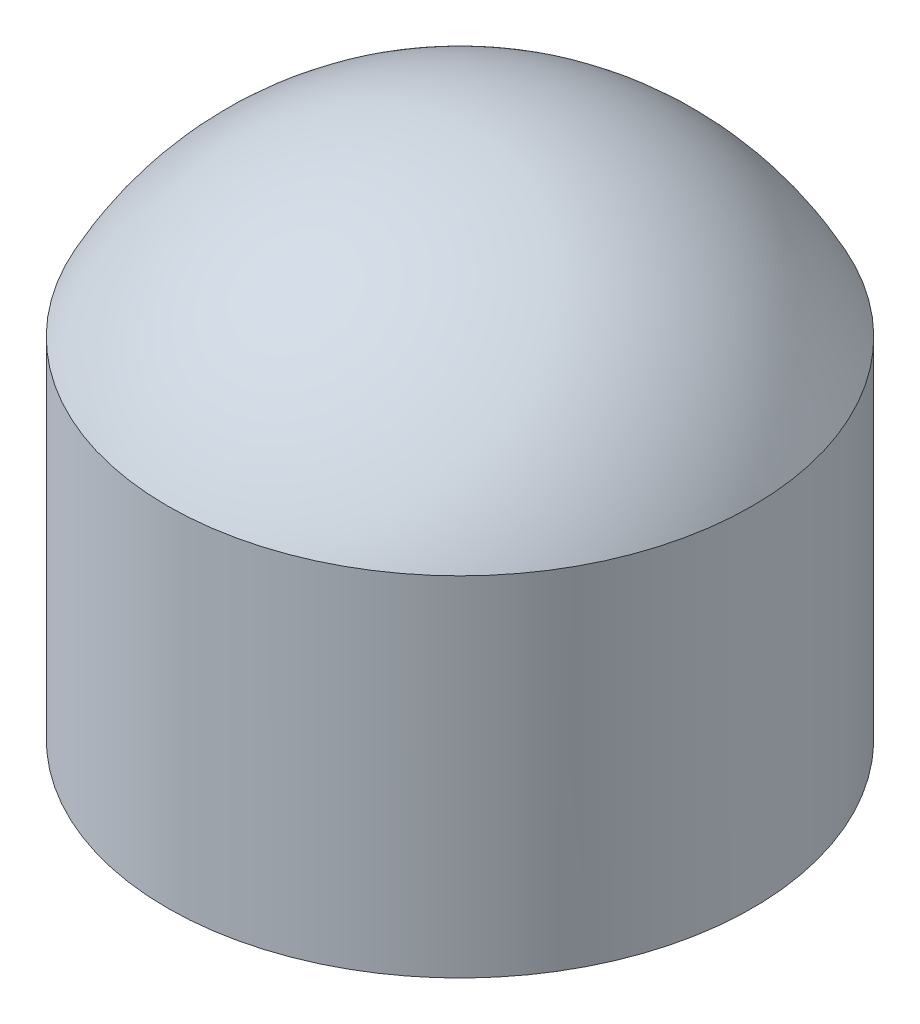
ISO-10303-21;
HEADER;
FILE_DESCRIPTION(('STEP AP214'),'2;1');
FILE_NAME('part.step','',(''),(''),'','','');
FILE_SCHEMA(('AUTOMOTIVE_DESIGN { 1 0 10303 214 1 1 1 1 }'));
ENDSEC;
DATA;
#1=APPLICATION_CONTEXT('core data for automotive mechanical design processes');
#2=APPLICATION_PROTOCOL_DEFINITION('international standard','automotive_design',2000,#1);
#3=PRODUCT_CONTEXT('',#1,'mechanical');
#4=PRODUCT('Part','Part','',(#3));
#5=PRODUCT_RELATED_PRODUCT_CATEGORY('part','',(#4));
#6=PRODUCT_DEFINITION_FORMATION('','',#4);
#7=PRODUCT_DEFINITION_CONTEXT('part definition',#1,'design');
#8=PRODUCT_DEFINITION('design','',#6,#7);
#9=PRODUCT_DEFINITION_SHAPE('','',#8);
#10=(LENGTH_UNIT() NAMED_UNIT(*) SI_UNIT(.MILLI.,.METRE.));
#11=(NAMED_UNIT(*) PLANE_ANGLE_UNIT() SI_UNIT($,.RADIAN.));
#12=(NAMED_UNIT(*) SI_UNIT($,.STERADIAN.) SOLID_ANGLE_UNIT());
#13=UNCERTAINTY_MEASURE_WITH_UNIT(LENGTH_MEASURE(1.E-05),#10,'distance_accuracy_value','');
#14=(GEOMETRIC_REPRESENTATION_CONTEXT(3) GLOBAL_UNCERTAINTY_ASSIGNED_CONTEXT((#13)) GLOBAL_UNIT_ASSIGNED_CONTEXT((#10,
#11,#12)) REPRESENTATION_CONTEXT('',''));
#15=CARTESIAN_POINT('',(0.,0.,0.));
#16=DIRECTION('',(0.,0.,1.));
#17=DIRECTION('',(1.,0.,0.));
#18=AXIS2_PLACEMENT_3D('',#15,#16,#17);
#19=CARTESIAN_POINT('',(0.,33.5788,0.));
#20=DIRECTION('',(0.,-1.,0.));
#21=DIRECTION('',(0.,0.,-1.));
#22=AXIS2_PLACEMENT_3D('',#19,#20,#21);
#23=CYLINDRICAL_SURFACE('',#22,28.2067);
#24=CARTESIAN_POINT('',(0.,33.5788,0.));
#25=DIRECTION('',(0.,1.,0.));
#26=DIRECTION('',(0.,0.,1.));
#27=AXIS2_PLACEMENT_3D('',#24,#25,#26);
#28=CIRCLE('',#27,28.2067);
#29=CARTESIAN_POINT('',(0.,33.5788,28.2067));
#30=VERTEX_POINT('',#29);
#31=EDGE_CURVE('E10',#30,#30,#28,.T.);
#32=ORIENTED_EDGE('',*,*,#31,.F.);
#33=EDGE_LOOP('',(#32));
#34=FACE_BOUND('',#33,.T.);
#35=CARTESIAN_POINT('',(0.,0.,0.));
#36=DIRECTION('',(0.,1.,0.));
#37=DIRECTION('',(0.,0.,1.));
#38=AXIS2_PLACEMENT_3D('',#35,#36,#37);
#39=CIRCLE('',#38,28.2067);
#40=CARTESIAN_POINT('',(0.,0.,28.2067));
#41=VERTEX_POINT('',#40);
#42=EDGE_CURVE('E34',#41,#41,#39,.T.);
#43=ORIENTED_EDGE('',*,*,#42,.T.);
#44=EDGE_LOOP('',(#43));
#45=FACE_BOUND('',#44,.T.);
#46=ADVANCED_FACE('F31',(#34,#45),#23,.T.);
#47=CARTESIAN_POINT('',(0.,0.,0.));
#48=DIRECTION('',(0.,1.,0.));
#49=DIRECTION('',(0.,0.,1.));
#50=AXIS2_PLACEMENT_3D('',#47,#48,#49);
#51=PLANE('',#50);
#52=CARTESIAN_POINT('',(0.,0.,0.));
#53=DIRECTION('',(0.,1.,0.));
#54=DIRECTION('',(0.,0.,1.));
#55=AXIS2_PLACEMENT_3D('',#52,#53,#54);
#56=CIRCLE('',#55,24.1427);
#57=CARTESIAN_POINT('',(0.,0.,24.1427));
#58=VERTEX_POINT('',#57);
#59=EDGE_CURVE('E43',#58,#58,#56,.T.);
#60=ORIENTED_EDGE('',*,*,#59,.T.);
#61=EDGE_LOOP('',(#60));
#62=FACE_BOUND('',#61,.T.);
#63=ORIENTED_EDGE('',*,*,#42,.F.);
#64=EDGE_LOOP('',(#63));
#65=FACE_BOUND('',#64,.T.);
#66=ADVANCED_FACE('F62',(#62,#65),#51,.F.);
#67=CARTESIAN_POINT('',(0.,19.0033214449062,0.));
#68=DIRECTION('',(0.,1.,0.));
#69=DIRECTION('',(1.,0.,0.));
#70=AXIS2_PLACEMENT_3D('',#67,#68,#69);
#71=SPHERICAL_SURFACE('',#70,31.75);
#72=ORIENTED_EDGE('',*,*,#31,.T.);
#73=EDGE_LOOP('',(#72));
#74=FACE_BOUND('',#73,.T.);
#75=ADVANCED_FACE('F58',(#74),#71,.T.);
#76=CARTESIAN_POINT('',(0.,33.5788,0.));
#77=DIRECTION('',(0.,-1.,0.));
#78=DIRECTION('',(0.,0.,-1.));
#79=AXIS2_PLACEMENT_3D('',#76,#77,#78);
#80=CYLINDRICAL_SURFACE('',#79,24.1427);
#81=CARTESIAN_POINT('',(0.,32.5548760682695,0.));
#82=DIRECTION('',(0.,-1.,0.));
#83=DIRECTION('',(0.,0.,-1.));
#84=AXIS2_PLACEMENT_3D('',#81,#82,#83);
#85=CIRCLE('',#84,24.1427);
#86=CARTESIAN_POINT('',(0.,32.5548760682695,-24.1427));
#87=VERTEX_POINT('',#86);
#88=EDGE_CURVE('E41',#87,#87,#85,.F.);
#89=ORIENTED_EDGE('',*,*,#88,.T.);
#90=EDGE_LOOP('',(#89));
#91=FACE_BOUND('',#90,.T.);
#92=ORIENTED_EDGE('',*,*,#59,.F.);
#93=EDGE_LOOP('',(#92));
#94=FACE_BOUND('',#93,.T.);
#95=ADVANCED_FACE('F49',(#91,#94),#80,.F.);
#96=CARTESIAN_POINT('',(0.,19.0033214449062,0.));
#97=DIRECTION('',(0.,1.,0.));
#98=DIRECTION('',(1.,0.,0.));
#99=AXIS2_PLACEMENT_3D('',#96,#97,#98);
#100=SPHERICAL_SURFACE('',#99,27.686);
#101=ORIENTED_EDGE('',*,*,#88,.F.);
#102=EDGE_LOOP('',(#101));
#103=FACE_BOUND('',#102,.T.);
#104=ADVANCED_FACE('F52',(#103),#100,.F.);
#105=CLOSED_SHELL('',(#46,#66,#75,#95,#104));
#106=MANIFOLD_SOLID_BREP('B2',#105);
#107=ADVANCED_BREP_SHAPE_REPRESENTATION('',(#18,#106),#14);
#108=SHAPE_DEFINITION_REPRESENTATION(#9,#107);
ENDSEC;
END-ISO-10303-21;
